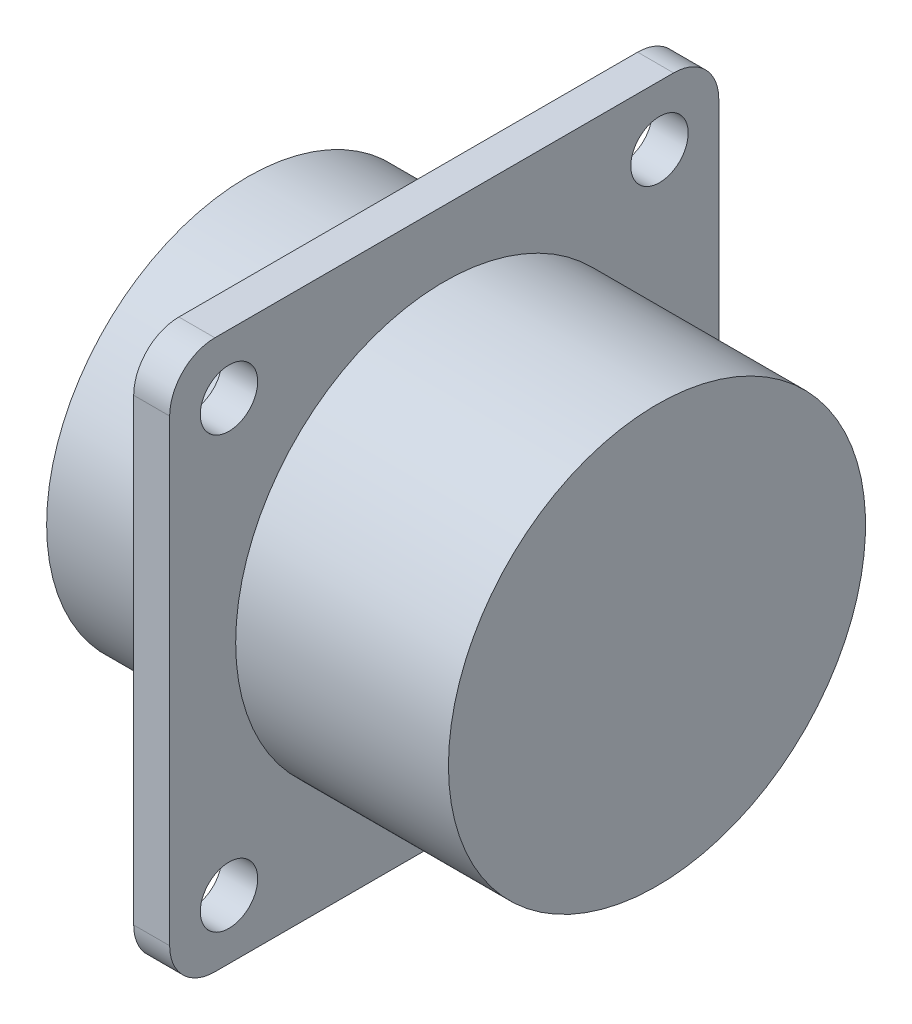
ISO-10303-21;
HEADER;
FILE_DESCRIPTION(('STEP AP214'),'2;1');
FILE_NAME('part.step','',(''),(''),'','','');
FILE_SCHEMA(('AUTOMOTIVE_DESIGN { 1 0 10303 214 1 1 1 1 }'));
ENDSEC;
DATA;
#1=APPLICATION_CONTEXT('core data for automotive mechanical design processes');
#2=APPLICATION_PROTOCOL_DEFINITION('international standard','automotive_design',2000,#1);
#3=PRODUCT_CONTEXT('',#1,'mechanical');
#4=PRODUCT('Part','Part','',(#3));
#5=PRODUCT_RELATED_PRODUCT_CATEGORY('part','',(#4));
#6=PRODUCT_DEFINITION_FORMATION('','',#4);
#7=PRODUCT_DEFINITION_CONTEXT('part definition',#1,'design');
#8=PRODUCT_DEFINITION('design','',#6,#7);
#9=PRODUCT_DEFINITION_SHAPE('','',#8);
#10=(LENGTH_UNIT() NAMED_UNIT(*) SI_UNIT(.MILLI.,.METRE.));
#11=(NAMED_UNIT(*) PLANE_ANGLE_UNIT() SI_UNIT($,.RADIAN.));
#12=(NAMED_UNIT(*) SI_UNIT($,.STERADIAN.) SOLID_ANGLE_UNIT());
#13=UNCERTAINTY_MEASURE_WITH_UNIT(LENGTH_MEASURE(1.E-05),#10,'distance_accuracy_value','');
#14=(GEOMETRIC_REPRESENTATION_CONTEXT(3) GLOBAL_UNCERTAINTY_ASSIGNED_CONTEXT((#13)) GLOBAL_UNIT_ASSIGNED_CONTEXT((#10,
#11,#12)) REPRESENTATION_CONTEXT('',''));
#15=CARTESIAN_POINT('',(0.,0.,0.));
#16=DIRECTION('',(0.,0.,1.));
#17=DIRECTION('',(1.,0.,0.));
#18=AXIS2_PLACEMENT_3D('',#15,#16,#17);
#19=CARTESIAN_POINT('',(10.668,13.335,0.));
#20=DIRECTION('',(1.,0.,0.));
#21=DIRECTION('',(0.,0.,-1.));
#22=AXIS2_PLACEMENT_3D('',#19,#20,#21);
#23=PLANE('',#22);
#24=CARTESIAN_POINT('',(10.668,0.,0.));
#25=DIRECTION('',(-1.,0.,0.));
#26=DIRECTION('',(0.,0.,1.));
#27=AXIS2_PLACEMENT_3D('',#24,#25,#26);
#28=CIRCLE('',#27,13.335);
#29=CARTESIAN_POINT('',(10.668,0.,13.335));
#30=VERTEX_POINT('',#29);
#31=EDGE_CURVE('E167',#30,#30,#28,.T.);
#32=ORIENTED_EDGE('',*,*,#31,.F.);
#33=EDGE_LOOP('',(#32));
#34=FACE_BOUND('',#33,.T.);
#35=CARTESIAN_POINT('',(10.668,14.2875,14.2875));
#36=DIRECTION('',(-1.,0.,0.));
#37=DIRECTION('',(0.,0.,1.));
#38=AXIS2_PLACEMENT_3D('',#35,#36,#37);
#39=CIRCLE('',#38,1.905);
#40=CARTESIAN_POINT('',(10.668,14.2875,16.1925));
#41=VERTEX_POINT('',#40);
#42=EDGE_CURVE('E157',#41,#41,#39,.T.);
#43=ORIENTED_EDGE('',*,*,#42,.F.);
#44=EDGE_LOOP('',(#43));
#45=FACE_BOUND('',#44,.T.);
#46=CARTESIAN_POINT('',(10.668,14.2875,-14.2875));
#47=DIRECTION('',(-1.,0.,0.));
#48=DIRECTION('',(0.,0.,1.));
#49=AXIS2_PLACEMENT_3D('',#46,#47,#48);
#50=CIRCLE('',#49,1.905);
#51=CARTESIAN_POINT('',(10.668,14.2875,-12.3825));
#52=VERTEX_POINT('',#51);
#53=EDGE_CURVE('E153',#52,#52,#50,.T.);
#54=ORIENTED_EDGE('',*,*,#53,.F.);
#55=EDGE_LOOP('',(#54));
#56=FACE_BOUND('',#55,.T.);
#57=CARTESIAN_POINT('',(10.668,-14.2875,-14.2875));
#58=DIRECTION('',(-1.,0.,0.));
#59=DIRECTION('',(0.,0.,1.));
#60=AXIS2_PLACEMENT_3D('',#57,#58,#59);
#61=CIRCLE('',#60,1.905);
#62=CARTESIAN_POINT('',(10.668,-14.2875,-12.3825));
#63=VERTEX_POINT('',#62);
#64=EDGE_CURVE('E149',#63,#63,#61,.T.);
#65=ORIENTED_EDGE('',*,*,#64,.F.);
#66=EDGE_LOOP('',(#65));
#67=FACE_BOUND('',#66,.T.);
#68=CARTESIAN_POINT('',(10.668,-14.2875,14.2875));
#69=DIRECTION('',(-1.,0.,0.));
#70=DIRECTION('',(0.,0.,1.));
#71=AXIS2_PLACEMENT_3D('',#68,#69,#70);
#72=CIRCLE('',#71,1.905);
#73=CARTESIAN_POINT('',(10.668,-14.2875,16.1925));
#74=VERTEX_POINT('',#73);
#75=EDGE_CURVE('E136',#74,#74,#72,.T.);
#76=ORIENTED_EDGE('',*,*,#75,.F.);
#77=EDGE_LOOP('',(#76));
#78=FACE_BOUND('',#77,.T.);
#79=CARTESIAN_POINT('',(10.668,-15.2245,-15.2245));
#80=DIRECTION('',(-1.,0.,0.));
#81=DIRECTION('',(0.,0.,1.));
#82=AXIS2_PLACEMENT_3D('',#79,#80,#81);
#83=CIRCLE('',#82,3.00000000000001);
#84=CARTESIAN_POINT('',(10.668,-15.2245,-18.2245));
#85=VERTEX_POINT('',#84);
#86=CARTESIAN_POINT('',(10.668,-18.2245,-15.2245));
#87=VERTEX_POINT('',#86);
#88=EDGE_CURVE('E120',#85,#87,#83,.T.);
#89=ORIENTED_EDGE('',*,*,#88,.T.);
#90=DIRECTION('',(0.,0.,1.));
#91=VECTOR('',#90,1.);
#92=CARTESIAN_POINT('',(10.668,-18.2245,-15.2245));
#93=LINE('',#92,#91);
#94=CARTESIAN_POINT('',(10.668,-18.2245,15.2245));
#95=VERTEX_POINT('',#94);
#96=EDGE_CURVE('E118',#87,#95,#93,.T.);
#97=ORIENTED_EDGE('',*,*,#96,.T.);
#98=CARTESIAN_POINT('',(10.668,-15.2245,15.2245));
#99=DIRECTION('',(-1.,0.,0.));
#100=DIRECTION('',(0.,0.,1.));
#101=AXIS2_PLACEMENT_3D('',#98,#99,#100);
#102=CIRCLE('',#101,3.);
#103=CARTESIAN_POINT('',(10.668,-15.2245,18.2245));
#104=VERTEX_POINT('',#103);
#105=EDGE_CURVE('E49',#95,#104,#102,.T.);
#106=ORIENTED_EDGE('',*,*,#105,.T.);
#107=DIRECTION('',(0.,1.,0.));
#108=VECTOR('',#107,1.);
#109=CARTESIAN_POINT('',(10.668,15.2245,18.2245));
#110=LINE('',#109,#108);
#111=CARTESIAN_POINT('',(10.668,15.2245,18.2245));
#112=VERTEX_POINT('',#111);
#113=EDGE_CURVE('E108',#104,#112,#110,.T.);
#114=ORIENTED_EDGE('',*,*,#113,.T.);
#115=CARTESIAN_POINT('',(10.668,15.2245,15.2245));
#116=DIRECTION('',(-1.,0.,0.));
#117=DIRECTION('',(0.,0.,-1.));
#118=AXIS2_PLACEMENT_3D('',#115,#116,#117);
#119=CIRCLE('',#118,3.);
#120=CARTESIAN_POINT('',(10.668,18.2245,15.2245));
#121=VERTEX_POINT('',#120);
#122=EDGE_CURVE('E114',#112,#121,#119,.T.);
#123=ORIENTED_EDGE('',*,*,#122,.T.);
#124=DIRECTION('',(0.,0.,-1.));
#125=VECTOR('',#124,1.);
#126=CARTESIAN_POINT('',(10.668,18.2245,-15.2245));
#127=LINE('',#126,#125);
#128=CARTESIAN_POINT('',(10.668,18.2245,-15.2245));
#129=VERTEX_POINT('',#128);
#130=EDGE_CURVE('E125',#121,#129,#127,.T.);
#131=ORIENTED_EDGE('',*,*,#130,.T.);
#132=CARTESIAN_POINT('',(10.668,15.2245,-15.2245));
#133=DIRECTION('',(-1.,0.,0.));
#134=DIRECTION('',(0.,0.,1.));
#135=AXIS2_PLACEMENT_3D('',#132,#133,#134);
#136=CIRCLE('',#135,3.);
#137=CARTESIAN_POINT('',(10.668,15.2245,-18.2245));
#138=VERTEX_POINT('',#137);
#139=EDGE_CURVE('E128',#129,#138,#136,.T.);
#140=ORIENTED_EDGE('',*,*,#139,.T.);
#141=DIRECTION('',(0.,-1.,0.));
#142=VECTOR('',#141,1.);
#143=CARTESIAN_POINT('',(10.668,15.2245,-18.2245));
#144=LINE('',#143,#142);
#145=EDGE_CURVE('E131',#138,#85,#144,.T.);
#146=ORIENTED_EDGE('',*,*,#145,.T.);
#147=EDGE_LOOP('',(#89,#97,#106,#114,#123,#131,#140,#146));
#148=FACE_BOUND('',#147,.T.);
#149=ADVANCED_FACE('F34',(#34,#45,#56,#67,#78,#148),#23,.F.);
#150=CARTESIAN_POINT('',(13.0556,30.,0.));
#151=DIRECTION('',(-1.,0.,0.));
#152=DIRECTION('',(0.,0.,1.));
#153=AXIS2_PLACEMENT_3D('',#150,#151,#152);
#154=PLANE('',#153);
#155=CARTESIAN_POINT('',(13.0556,0.,0.));
#156=DIRECTION('',(-1.,0.,0.));
#157=DIRECTION('',(0.,0.,1.));
#158=AXIS2_PLACEMENT_3D('',#155,#156,#157);
#159=CIRCLE('',#158,13.843);
#160=CARTESIAN_POINT('',(13.0556,0.,13.843));
#161=VERTEX_POINT('',#160);
#162=EDGE_CURVE('E164',#161,#161,#159,.T.);
#163=ORIENTED_EDGE('',*,*,#162,.T.);
#164=EDGE_LOOP('',(#163));
#165=FACE_BOUND('',#164,.T.);
#166=CARTESIAN_POINT('',(13.0556,14.2875,14.2875));
#167=DIRECTION('',(-1.,0.,0.));
#168=DIRECTION('',(0.,0.,1.));
#169=AXIS2_PLACEMENT_3D('',#166,#167,#168);
#170=CIRCLE('',#169,1.905);
#171=CARTESIAN_POINT('',(13.0556,14.2875,16.1925));
#172=VERTEX_POINT('',#171);
#173=EDGE_CURVE('E160',#172,#172,#170,.T.);
#174=ORIENTED_EDGE('',*,*,#173,.T.);
#175=EDGE_LOOP('',(#174));
#176=FACE_BOUND('',#175,.T.);
#177=CARTESIAN_POINT('',(13.0556,14.2875,-14.2875));
#178=DIRECTION('',(-1.,0.,0.));
#179=DIRECTION('',(0.,0.,1.));
#180=AXIS2_PLACEMENT_3D('',#177,#178,#179);
#181=CIRCLE('',#180,1.905);
#182=CARTESIAN_POINT('',(13.0556,14.2875,-12.3825));
#183=VERTEX_POINT('',#182);
#184=EDGE_CURVE('E156',#183,#183,#181,.T.);
#185=ORIENTED_EDGE('',*,*,#184,.T.);
#186=EDGE_LOOP('',(#185));
#187=FACE_BOUND('',#186,.T.);
#188=CARTESIAN_POINT('',(13.0556,-14.2875,-14.2875));
#189=DIRECTION('',(-1.,0.,0.));
#190=DIRECTION('',(0.,0.,1.));
#191=AXIS2_PLACEMENT_3D('',#188,#189,#190);
#192=CIRCLE('',#191,1.905);
#193=CARTESIAN_POINT('',(13.0556,-14.2875,-12.3825));
#194=VERTEX_POINT('',#193);
#195=EDGE_CURVE('E152',#194,#194,#192,.T.);
#196=ORIENTED_EDGE('',*,*,#195,.T.);
#197=EDGE_LOOP('',(#196));
#198=FACE_BOUND('',#197,.T.);
#199=CARTESIAN_POINT('',(13.0556,-14.2875,14.2875));
#200=DIRECTION('',(-1.,0.,0.));
#201=DIRECTION('',(0.,0.,1.));
#202=AXIS2_PLACEMENT_3D('',#199,#200,#201);
#203=CIRCLE('',#202,1.905);
#204=CARTESIAN_POINT('',(13.0556,-14.2875,16.1925));
#205=VERTEX_POINT('',#204);
#206=EDGE_CURVE('E148',#205,#205,#203,.T.);
#207=ORIENTED_EDGE('',*,*,#206,.T.);
#208=EDGE_LOOP('',(#207));
#209=FACE_BOUND('',#208,.T.);
#210=CARTESIAN_POINT('',(13.0556,-15.2245,-15.2245));
#211=DIRECTION('',(-1.,0.,0.));
#212=DIRECTION('',(0.,0.,1.));
#213=AXIS2_PLACEMENT_3D('',#210,#211,#212);
#214=CIRCLE('',#213,3.00000000000001);
#215=CARTESIAN_POINT('',(13.0556,-15.2245,-18.2245));
#216=VERTEX_POINT('',#215);
#217=CARTESIAN_POINT('',(13.0556,-18.2245,-15.2245));
#218=VERTEX_POINT('',#217);
#219=EDGE_CURVE('E12',#216,#218,#214,.T.);
#220=ORIENTED_EDGE('',*,*,#219,.F.);
#221=DIRECTION('',(0.,-1.,0.));
#222=VECTOR('',#221,1.);
#223=CARTESIAN_POINT('',(13.0556,30.,-18.2245));
#224=LINE('',#223,#222);
#225=CARTESIAN_POINT('',(13.0556,15.2245,-18.2245));
#226=VERTEX_POINT('',#225);
#227=EDGE_CURVE('E42',#226,#216,#224,.T.);
#228=ORIENTED_EDGE('',*,*,#227,.F.);
#229=CARTESIAN_POINT('',(13.0556,15.2245,-15.2245));
#230=DIRECTION('',(-1.,0.,0.));
#231=DIRECTION('',(0.,0.,1.));
#232=AXIS2_PLACEMENT_3D('',#229,#230,#231);
#233=CIRCLE('',#232,3.);
#234=CARTESIAN_POINT('',(13.0556,18.2245,-15.2245));
#235=VERTEX_POINT('',#234);
#236=EDGE_CURVE('E190',#235,#226,#233,.T.);
#237=ORIENTED_EDGE('',*,*,#236,.F.);
#238=DIRECTION('',(0.,0.,-1.));
#239=VECTOR('',#238,1.);
#240=CARTESIAN_POINT('',(13.0556,18.2245,0.));
#241=LINE('',#240,#239);
#242=CARTESIAN_POINT('',(13.0556,18.2245,15.2245));
#243=VERTEX_POINT('',#242);
#244=EDGE_CURVE('E188',#243,#235,#241,.T.);
#245=ORIENTED_EDGE('',*,*,#244,.F.);
#246=CARTESIAN_POINT('',(13.0556,15.2245,15.2245));
#247=DIRECTION('',(-1.,0.,0.));
#248=DIRECTION('',(0.,0.,1.));
#249=AXIS2_PLACEMENT_3D('',#246,#247,#248);
#250=CIRCLE('',#249,3.);
#251=CARTESIAN_POINT('',(13.0556,15.2245,18.2245));
#252=VERTEX_POINT('',#251);
#253=EDGE_CURVE('E186',#252,#243,#250,.T.);
#254=ORIENTED_EDGE('',*,*,#253,.F.);
#255=DIRECTION('',(0.,1.,0.));
#256=VECTOR('',#255,1.);
#257=CARTESIAN_POINT('',(13.0556,30.,18.2245));
#258=LINE('',#257,#256);
#259=CARTESIAN_POINT('',(13.0556,-15.2245,18.2245));
#260=VERTEX_POINT('',#259);
#261=EDGE_CURVE('E184',#260,#252,#258,.T.);
#262=ORIENTED_EDGE('',*,*,#261,.F.);
#263=CARTESIAN_POINT('',(13.0556,-15.2245,15.2245));
#264=DIRECTION('',(-1.,0.,0.));
#265=DIRECTION('',(0.,0.,1.));
#266=AXIS2_PLACEMENT_3D('',#263,#264,#265);
#267=CIRCLE('',#266,3.);
#268=CARTESIAN_POINT('',(13.0556,-18.2245,15.2245));
#269=VERTEX_POINT('',#268);
#270=EDGE_CURVE('E101',#269,#260,#267,.T.);
#271=ORIENTED_EDGE('',*,*,#270,.F.);
#272=DIRECTION('',(0.,0.,1.));
#273=VECTOR('',#272,1.);
#274=CARTESIAN_POINT('',(13.0556,-18.2245,0.));
#275=LINE('',#274,#273);
#276=EDGE_CURVE('E173',#218,#269,#275,.T.);
#277=ORIENTED_EDGE('',*,*,#276,.F.);
#278=EDGE_LOOP('',(#220,#228,#237,#245,#254,#262,#271,#277));
#279=FACE_BOUND('',#278,.T.);
#280=ADVANCED_FACE('F204',(#165,#176,#187,#198,#209,#279),#154,.F.);
#281=CARTESIAN_POINT('',(0.,0.,0.));
#282=DIRECTION('',(1.,0.,0.));
#283=DIRECTION('',(0.,0.,-1.));
#284=AXIS2_PLACEMENT_3D('',#281,#282,#283);
#285=PLANE('',#284);
#286=CARTESIAN_POINT('',(0.,0.,0.));
#287=DIRECTION('',(-1.,0.,0.));
#288=DIRECTION('',(0.,0.,1.));
#289=AXIS2_PLACEMENT_3D('',#286,#287,#288);
#290=CIRCLE('',#289,13.335);
#291=CARTESIAN_POINT('',(0.,0.,13.335));
#292=VERTEX_POINT('',#291);
#293=EDGE_CURVE('E170',#292,#292,#290,.T.);
#294=ORIENTED_EDGE('',*,*,#293,.T.);
#295=EDGE_LOOP('',(#294));
#296=FACE_BOUND('',#295,.T.);
#297=ADVANCED_FACE('F36',(#296),#285,.F.);
#298=CARTESIAN_POINT('',(0.,0.,0.));
#299=DIRECTION('',(-1.,0.,0.));
#300=DIRECTION('',(0.,0.,1.));
#301=AXIS2_PLACEMENT_3D('',#298,#299,#300);
#302=CYLINDRICAL_SURFACE('',#301,13.335);
#303=ORIENTED_EDGE('',*,*,#293,.F.);
#304=EDGE_LOOP('',(#303));
#305=FACE_BOUND('',#304,.T.);
#306=ORIENTED_EDGE('',*,*,#31,.T.);
#307=EDGE_LOOP('',(#306));
#308=FACE_BOUND('',#307,.T.);
#309=ADVANCED_FACE('F237',(#305,#308),#302,.T.);
#310=CARTESIAN_POINT('',(0.,0.,0.));
#311=DIRECTION('',(-1.,0.,0.));
#312=DIRECTION('',(0.,0.,1.));
#313=AXIS2_PLACEMENT_3D('',#310,#311,#312);
#314=CYLINDRICAL_SURFACE('',#313,13.843);
#315=ORIENTED_EDGE('',*,*,#162,.F.);
#316=EDGE_LOOP('',(#315));
#317=FACE_BOUND('',#316,.T.);
#318=CARTESIAN_POINT('',(27.178,0.,0.));
#319=DIRECTION('',(-1.,0.,0.));
#320=DIRECTION('',(0.,0.,1.));
#321=AXIS2_PLACEMENT_3D('',#318,#319,#320);
#322=CIRCLE('',#321,13.843);
#323=CARTESIAN_POINT('',(27.178,0.,13.843));
#324=VERTEX_POINT('',#323);
#325=EDGE_CURVE('E161',#324,#324,#322,.T.);
#326=ORIENTED_EDGE('',*,*,#325,.T.);
#327=EDGE_LOOP('',(#326));
#328=FACE_BOUND('',#327,.T.);
#329=ADVANCED_FACE('F239',(#317,#328),#314,.T.);
#330=CARTESIAN_POINT('',(27.178,13.843,0.));
#331=DIRECTION('',(-1.,0.,0.));
#332=DIRECTION('',(0.,0.,1.));
#333=AXIS2_PLACEMENT_3D('',#330,#331,#332);
#334=PLANE('',#333);
#335=ORIENTED_EDGE('',*,*,#325,.F.);
#336=EDGE_LOOP('',(#335));
#337=FACE_BOUND('',#336,.T.);
#338=ADVANCED_FACE('F245',(#337),#334,.F.);
#339=CARTESIAN_POINT('',(27.178,14.2875,14.2875));
#340=DIRECTION('',(-1.,0.,0.));
#341=DIRECTION('',(0.,0.,1.));
#342=AXIS2_PLACEMENT_3D('',#339,#340,#341);
#343=CYLINDRICAL_SURFACE('',#342,1.905);
#344=ORIENTED_EDGE('',*,*,#42,.T.);
#345=EDGE_LOOP('',(#344));
#346=FACE_BOUND('',#345,.T.);
#347=ORIENTED_EDGE('',*,*,#173,.F.);
#348=EDGE_LOOP('',(#347));
#349=FACE_BOUND('',#348,.T.);
#350=ADVANCED_FACE('F265',(#346,#349),#343,.F.);
#351=CARTESIAN_POINT('',(27.178,14.2875,-14.2875));
#352=DIRECTION('',(-1.,0.,0.));
#353=DIRECTION('',(0.,0.,1.));
#354=AXIS2_PLACEMENT_3D('',#351,#352,#353);
#355=CYLINDRICAL_SURFACE('',#354,1.905);
#356=ORIENTED_EDGE('',*,*,#53,.T.);
#357=EDGE_LOOP('',(#356));
#358=FACE_BOUND('',#357,.T.);
#359=ORIENTED_EDGE('',*,*,#184,.F.);
#360=EDGE_LOOP('',(#359));
#361=FACE_BOUND('',#360,.T.);
#362=ADVANCED_FACE('F270',(#358,#361),#355,.F.);
#363=CARTESIAN_POINT('',(27.178,-14.2875,-14.2875));
#364=DIRECTION('',(-1.,0.,0.));
#365=DIRECTION('',(0.,0.,1.));
#366=AXIS2_PLACEMENT_3D('',#363,#364,#365);
#367=CYLINDRICAL_SURFACE('',#366,1.905);
#368=ORIENTED_EDGE('',*,*,#64,.T.);
#369=EDGE_LOOP('',(#368));
#370=FACE_BOUND('',#369,.T.);
#371=ORIENTED_EDGE('',*,*,#195,.F.);
#372=EDGE_LOOP('',(#371));
#373=FACE_BOUND('',#372,.T.);
#374=ADVANCED_FACE('F281',(#370,#373),#367,.F.);
#375=CARTESIAN_POINT('',(27.178,-14.2875,14.2875));
#376=DIRECTION('',(-1.,0.,0.));
#377=DIRECTION('',(0.,0.,1.));
#378=AXIS2_PLACEMENT_3D('',#375,#376,#377);
#379=CYLINDRICAL_SURFACE('',#378,1.905);
#380=ORIENTED_EDGE('',*,*,#75,.T.);
#381=EDGE_LOOP('',(#380));
#382=FACE_BOUND('',#381,.T.);
#383=ORIENTED_EDGE('',*,*,#206,.F.);
#384=EDGE_LOOP('',(#383));
#385=FACE_BOUND('',#384,.T.);
#386=ADVANCED_FACE('F291',(#382,#385),#379,.F.);
#387=CARTESIAN_POINT('',(27.178,-15.2245,-15.2245));
#388=DIRECTION('',(-1.,0.,0.));
#389=DIRECTION('',(0.,0.,1.));
#390=AXIS2_PLACEMENT_3D('',#387,#388,#389);
#391=CYLINDRICAL_SURFACE('',#390,3.00000000000001);
#392=ORIENTED_EDGE('',*,*,#219,.T.);
#393=DIRECTION('',(-1.,0.,0.));
#394=VECTOR('',#393,1.);
#395=CARTESIAN_POINT('',(27.178,-18.2245,-15.2245));
#396=LINE('',#395,#394);
#397=EDGE_CURVE('E57',#218,#87,#396,.T.);
#398=ORIENTED_EDGE('',*,*,#397,.T.);
#399=ORIENTED_EDGE('',*,*,#88,.F.);
#400=DIRECTION('',(-1.,0.,0.));
#401=VECTOR('',#400,1.);
#402=CARTESIAN_POINT('',(27.178,-15.2245,-18.2245));
#403=LINE('',#402,#401);
#404=EDGE_CURVE('E134',#216,#85,#403,.T.);
#405=ORIENTED_EDGE('',*,*,#404,.F.);
#406=EDGE_LOOP('',(#392,#398,#399,#405));
#407=FACE_BOUND('',#406,.T.);
#408=ADVANCED_FACE('F202',(#407),#391,.T.);
#409=CARTESIAN_POINT('',(27.178,15.2245,-18.2245));
#410=DIRECTION('',(0.,0.,-1.));
#411=DIRECTION('',(0.,1.,0.));
#412=AXIS2_PLACEMENT_3D('',#409,#410,#411);
#413=PLANE('',#412);
#414=ORIENTED_EDGE('',*,*,#227,.T.);
#415=ORIENTED_EDGE('',*,*,#404,.T.);
#416=ORIENTED_EDGE('',*,*,#145,.F.);
#417=DIRECTION('',(-1.,0.,0.));
#418=VECTOR('',#417,1.);
#419=CARTESIAN_POINT('',(27.178,15.2245,-18.2245));
#420=LINE('',#419,#418);
#421=EDGE_CURVE('E137',#226,#138,#420,.T.);
#422=ORIENTED_EDGE('',*,*,#421,.F.);
#423=EDGE_LOOP('',(#414,#415,#416,#422));
#424=FACE_BOUND('',#423,.T.);
#425=ADVANCED_FACE('F195',(#424),#413,.T.);
#426=CARTESIAN_POINT('',(27.178,15.2245,-15.2245));
#427=DIRECTION('',(-1.,0.,0.));
#428=DIRECTION('',(0.,0.,1.));
#429=AXIS2_PLACEMENT_3D('',#426,#427,#428);
#430=CYLINDRICAL_SURFACE('',#429,3.);
#431=ORIENTED_EDGE('',*,*,#236,.T.);
#432=ORIENTED_EDGE('',*,*,#421,.T.);
#433=ORIENTED_EDGE('',*,*,#139,.F.);
#434=DIRECTION('',(-1.,0.,0.));
#435=VECTOR('',#434,1.);
#436=CARTESIAN_POINT('',(27.178,18.2245,-15.2245));
#437=LINE('',#436,#435);
#438=EDGE_CURVE('E139',#235,#129,#437,.T.);
#439=ORIENTED_EDGE('',*,*,#438,.F.);
#440=EDGE_LOOP('',(#431,#432,#433,#439));
#441=FACE_BOUND('',#440,.T.);
#442=ADVANCED_FACE('F210',(#441),#430,.T.);
#443=CARTESIAN_POINT('',(27.178,18.2245,-15.2245));
#444=DIRECTION('',(0.,1.,0.));
#445=DIRECTION('',(0.,0.,1.));
#446=AXIS2_PLACEMENT_3D('',#443,#444,#445);
#447=PLANE('',#446);
#448=ORIENTED_EDGE('',*,*,#244,.T.);
#449=ORIENTED_EDGE('',*,*,#438,.T.);
#450=ORIENTED_EDGE('',*,*,#130,.F.);
#451=DIRECTION('',(-1.,0.,0.));
#452=VECTOR('',#451,1.);
#453=CARTESIAN_POINT('',(27.178,18.2245,15.2245));
#454=LINE('',#453,#452);
#455=EDGE_CURVE('E141',#243,#121,#454,.T.);
#456=ORIENTED_EDGE('',*,*,#455,.F.);
#457=EDGE_LOOP('',(#448,#449,#450,#456));
#458=FACE_BOUND('',#457,.T.);
#459=ADVANCED_FACE('F215',(#458),#447,.T.);
#460=CARTESIAN_POINT('',(27.178,15.2245,15.2245));
#461=DIRECTION('',(-1.,0.,0.));
#462=DIRECTION('',(0.,0.,1.));
#463=AXIS2_PLACEMENT_3D('',#460,#461,#462);
#464=CYLINDRICAL_SURFACE('',#463,3.);
#465=ORIENTED_EDGE('',*,*,#253,.T.);
#466=ORIENTED_EDGE('',*,*,#455,.T.);
#467=ORIENTED_EDGE('',*,*,#122,.F.);
#468=DIRECTION('',(-1.,0.,0.));
#469=VECTOR('',#468,1.);
#470=CARTESIAN_POINT('',(27.178,15.2245,18.2245));
#471=LINE('',#470,#469);
#472=EDGE_CURVE('E104',#252,#112,#471,.T.);
#473=ORIENTED_EDGE('',*,*,#472,.F.);
#474=EDGE_LOOP('',(#465,#466,#467,#473));
#475=FACE_BOUND('',#474,.T.);
#476=ADVANCED_FACE('F217',(#475),#464,.T.);
#477=CARTESIAN_POINT('',(27.178,15.2245,18.2245));
#478=DIRECTION('',(0.,0.,1.));
#479=DIRECTION('',(0.,-1.,0.));
#480=AXIS2_PLACEMENT_3D('',#477,#478,#479);
#481=PLANE('',#480);
#482=ORIENTED_EDGE('',*,*,#261,.T.);
#483=ORIENTED_EDGE('',*,*,#472,.T.);
#484=ORIENTED_EDGE('',*,*,#113,.F.);
#485=DIRECTION('',(-1.,0.,0.));
#486=VECTOR('',#485,1.);
#487=CARTESIAN_POINT('',(27.178,-15.2245,18.2245));
#488=LINE('',#487,#486);
#489=EDGE_CURVE('E97',#260,#104,#488,.T.);
#490=ORIENTED_EDGE('',*,*,#489,.F.);
#491=EDGE_LOOP('',(#482,#483,#484,#490));
#492=FACE_BOUND('',#491,.T.);
#493=ADVANCED_FACE('F109',(#492),#481,.T.);
#494=CARTESIAN_POINT('',(27.178,-15.2245,15.2245));
#495=DIRECTION('',(-1.,0.,0.));
#496=DIRECTION('',(0.,0.,1.));
#497=AXIS2_PLACEMENT_3D('',#494,#495,#496);
#498=CYLINDRICAL_SURFACE('',#497,3.);
#499=ORIENTED_EDGE('',*,*,#270,.T.);
#500=ORIENTED_EDGE('',*,*,#489,.T.);
#501=ORIENTED_EDGE('',*,*,#105,.F.);
#502=DIRECTION('',(-1.,0.,0.));
#503=VECTOR('',#502,1.);
#504=CARTESIAN_POINT('',(27.178,-18.2245,15.2245));
#505=LINE('',#504,#503);
#506=EDGE_CURVE('E105',#269,#95,#505,.T.);
#507=ORIENTED_EDGE('',*,*,#506,.F.);
#508=EDGE_LOOP('',(#499,#500,#501,#507));
#509=FACE_BOUND('',#508,.T.);
#510=ADVANCED_FACE('F99',(#509),#498,.T.);
#511=CARTESIAN_POINT('',(27.178,-18.2245,-15.2245));
#512=DIRECTION('',(0.,-1.,0.));
#513=DIRECTION('',(0.,0.,-1.));
#514=AXIS2_PLACEMENT_3D('',#511,#512,#513);
#515=PLANE('',#514);
#516=ORIENTED_EDGE('',*,*,#276,.T.);
#517=ORIENTED_EDGE('',*,*,#506,.T.);
#518=ORIENTED_EDGE('',*,*,#96,.F.);
#519=ORIENTED_EDGE('',*,*,#397,.F.);
#520=EDGE_LOOP('',(#516,#517,#518,#519));
#521=FACE_BOUND('',#520,.T.);
#522=ADVANCED_FACE('F205',(#521),#515,.T.);
#523=CLOSED_SHELL('',(#149,#280,#297,#309,#329,#338,#350,#362,#374,#386,#408,#425,#442,#459,
#476,#493,#510,#522));
#524=MANIFOLD_SOLID_BREP('B2',#523);
#525=ADVANCED_BREP_SHAPE_REPRESENTATION('',(#18,#524),#14);
#526=SHAPE_DEFINITION_REPRESENTATION(#9,#525);
ENDSEC;
END-ISO-10303-21;
